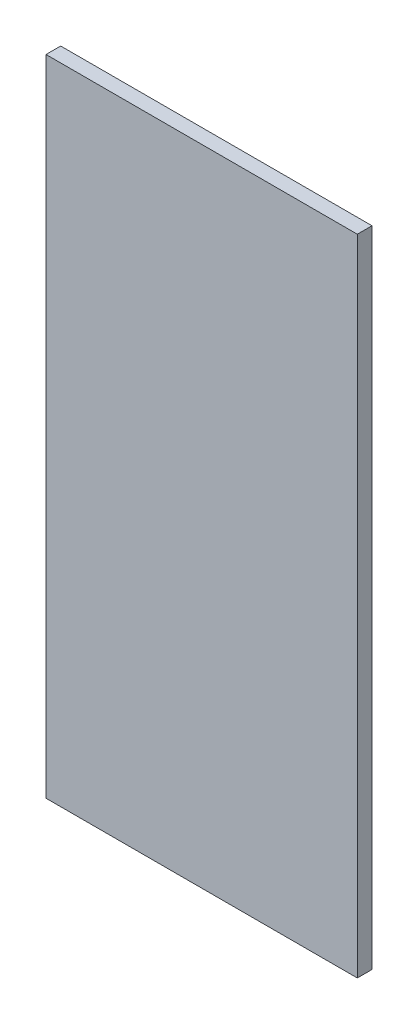
ISO-10303-21;
HEADER;
FILE_DESCRIPTION(('STEP AP214'),'2;1');
FILE_NAME('part.step','',(''),(''),'','','');
FILE_SCHEMA(('AUTOMOTIVE_DESIGN { 1 0 10303 214 1 1 1 1 }'));
ENDSEC;
DATA;
#1=APPLICATION_CONTEXT('core data for automotive mechanical design processes');
#2=APPLICATION_PROTOCOL_DEFINITION('international standard','automotive_design',2000,#1);
#3=PRODUCT_CONTEXT('',#1,'mechanical');
#4=PRODUCT('Part','Part','',(#3));
#5=PRODUCT_RELATED_PRODUCT_CATEGORY('part','',(#4));
#6=PRODUCT_DEFINITION_FORMATION('','',#4);
#7=PRODUCT_DEFINITION_CONTEXT('part definition',#1,'design');
#8=PRODUCT_DEFINITION('design','',#6,#7);
#9=PRODUCT_DEFINITION_SHAPE('','',#8);
#10=(LENGTH_UNIT() NAMED_UNIT(*) SI_UNIT(.MILLI.,.METRE.));
#11=(NAMED_UNIT(*) PLANE_ANGLE_UNIT() SI_UNIT($,.RADIAN.));
#12=(NAMED_UNIT(*) SI_UNIT($,.STERADIAN.) SOLID_ANGLE_UNIT());
#13=UNCERTAINTY_MEASURE_WITH_UNIT(LENGTH_MEASURE(1.E-05),#10,'distance_accuracy_value','');
#14=(GEOMETRIC_REPRESENTATION_CONTEXT(3) GLOBAL_UNCERTAINTY_ASSIGNED_CONTEXT((#13)) GLOBAL_UNIT_ASSIGNED_CONTEXT((#10,
#11,#12)) REPRESENTATION_CONTEXT('',''));
#15=CARTESIAN_POINT('',(0.,0.,0.));
#16=DIRECTION('',(0.,0.,1.));
#17=DIRECTION('',(1.,0.,0.));
#18=AXIS2_PLACEMENT_3D('',#15,#16,#17);
#19=CARTESIAN_POINT('',(860.,658.,-15.));
#20=DIRECTION('',(0.,1.,0.));
#21=DIRECTION('',(-1.,0.,0.));
#22=AXIS2_PLACEMENT_3D('',#19,#20,#21);
#23=PLANE('',#22);
#24=DIRECTION('',(0.,0.,1.));
#25=VECTOR('',#24,1.);
#26=CARTESIAN_POINT('',(579.,658.,-15.));
#27=LINE('',#26,#25);
#28=CARTESIAN_POINT('',(579.,658.,-15.));
#29=VERTEX_POINT('',#28);
#30=CARTESIAN_POINT('',(579.,658.,0.));
#31=VERTEX_POINT('',#30);
#32=EDGE_CURVE('E80',#29,#31,#27,.T.);
#33=ORIENTED_EDGE('',*,*,#32,.T.);
#34=DIRECTION('',(-1.,0.,0.));
#35=VECTOR('',#34,1.);
#36=CARTESIAN_POINT('',(860.,658.,0.));
#37=LINE('',#36,#35);
#38=CARTESIAN_POINT('',(897.,658.,0.));
#39=VERTEX_POINT('',#38);
#40=EDGE_CURVE('E95',#39,#31,#37,.T.);
#41=ORIENTED_EDGE('',*,*,#40,.F.);
#42=DIRECTION('',(0.,0.,1.));
#43=VECTOR('',#42,1.);
#44=CARTESIAN_POINT('',(897.,658.,-15.));
#45=LINE('',#44,#43);
#46=CARTESIAN_POINT('',(897.,658.,-15.));
#47=VERTEX_POINT('',#46);
#48=EDGE_CURVE('E101',#47,#39,#45,.T.);
#49=ORIENTED_EDGE('',*,*,#48,.F.);
#50=DIRECTION('',(-1.,0.,0.));
#51=VECTOR('',#50,1.);
#52=CARTESIAN_POINT('',(860.,658.,-15.));
#53=LINE('',#52,#51);
#54=EDGE_CURVE('E94',#47,#29,#53,.T.);
#55=ORIENTED_EDGE('',*,*,#54,.T.);
#56=EDGE_LOOP('',(#33,#41,#49,#55));
#57=FACE_BOUND('',#56,.T.);
#58=ADVANCED_FACE('F38',(#57),#23,.T.);
#59=CARTESIAN_POINT('',(0.,0.,-15.));
#60=DIRECTION('',(0.,-1.,0.));
#61=DIRECTION('',(0.,0.,-1.));
#62=AXIS2_PLACEMENT_3D('',#59,#60,#61);
#63=PLANE('',#62);
#64=DIRECTION('',(0.,0.,1.));
#65=VECTOR('',#64,1.);
#66=CARTESIAN_POINT('',(579.,0.,-15.));
#67=LINE('',#66,#65);
#68=CARTESIAN_POINT('',(579.,0.,-15.));
#69=VERTEX_POINT('',#68);
#70=CARTESIAN_POINT('',(579.,0.,0.));
#71=VERTEX_POINT('',#70);
#72=EDGE_CURVE('E52',#69,#71,#67,.T.);
#73=ORIENTED_EDGE('',*,*,#72,.F.);
#74=DIRECTION('',(1.,0.,0.));
#75=VECTOR('',#74,1.);
#76=CARTESIAN_POINT('',(0.,0.,-15.));
#77=LINE('',#76,#75);
#78=CARTESIAN_POINT('',(897.,0.,-15.));
#79=VERTEX_POINT('',#78);
#80=EDGE_CURVE('E87',#69,#79,#77,.T.);
#81=ORIENTED_EDGE('',*,*,#80,.T.);
#82=DIRECTION('',(0.,0.,1.));
#83=VECTOR('',#82,1.);
#84=CARTESIAN_POINT('',(897.,0.,-15.));
#85=LINE('',#84,#83);
#86=CARTESIAN_POINT('',(897.,0.,0.));
#87=VERTEX_POINT('',#86);
#88=EDGE_CURVE('E104',#79,#87,#85,.T.);
#89=ORIENTED_EDGE('',*,*,#88,.T.);
#90=DIRECTION('',(1.,0.,0.));
#91=VECTOR('',#90,1.);
#92=CARTESIAN_POINT('',(0.,0.,0.));
#93=LINE('',#92,#91);
#94=EDGE_CURVE('E59',#71,#87,#93,.T.);
#95=ORIENTED_EDGE('',*,*,#94,.F.);
#96=EDGE_LOOP('',(#73,#81,#89,#95));
#97=FACE_BOUND('',#96,.T.);
#98=ADVANCED_FACE('F40',(#97),#63,.T.);
#99=CARTESIAN_POINT('',(0.,0.,-15.));
#100=DIRECTION('',(0.,0.,1.));
#101=DIRECTION('',(1.,0.,0.));
#102=AXIS2_PLACEMENT_3D('',#99,#100,#101);
#103=PLANE('',#102);
#104=ORIENTED_EDGE('',*,*,#80,.F.);
#105=DIRECTION('',(0.,1.,0.));
#106=VECTOR('',#105,1.);
#107=CARTESIAN_POINT('',(579.,658.,-15.));
#108=LINE('',#107,#106);
#109=EDGE_CURVE('E77',#69,#29,#108,.T.);
#110=ORIENTED_EDGE('',*,*,#109,.T.);
#111=ORIENTED_EDGE('',*,*,#54,.F.);
#112=DIRECTION('',(0.,-1.,0.));
#113=VECTOR('',#112,1.);
#114=CARTESIAN_POINT('',(897.,0.,-15.));
#115=LINE('',#114,#113);
#116=EDGE_CURVE('E93',#47,#79,#115,.T.);
#117=ORIENTED_EDGE('',*,*,#116,.T.);
#118=EDGE_LOOP('',(#104,#110,#111,#117));
#119=FACE_BOUND('',#118,.T.);
#120=ADVANCED_FACE('F91',(#119),#103,.F.);
#121=CARTESIAN_POINT('',(0.,0.,0.));
#122=DIRECTION('',(0.,0.,1.));
#123=DIRECTION('',(1.,0.,0.));
#124=AXIS2_PLACEMENT_3D('',#121,#122,#123);
#125=PLANE('',#124);
#126=DIRECTION('',(0.,1.,0.));
#127=VECTOR('',#126,1.);
#128=CARTESIAN_POINT('',(579.,0.,0.));
#129=LINE('',#128,#127);
#130=EDGE_CURVE('E11',#71,#31,#129,.T.);
#131=ORIENTED_EDGE('',*,*,#130,.F.);
#132=ORIENTED_EDGE('',*,*,#94,.T.);
#133=DIRECTION('',(0.,-1.,0.));
#134=VECTOR('',#133,1.);
#135=CARTESIAN_POINT('',(897.,0.,0.));
#136=LINE('',#135,#134);
#137=EDGE_CURVE('E46',#39,#87,#136,.T.);
#138=ORIENTED_EDGE('',*,*,#137,.F.);
#139=ORIENTED_EDGE('',*,*,#40,.T.);
#140=EDGE_LOOP('',(#131,#132,#138,#139));
#141=FACE_BOUND('',#140,.T.);
#142=ADVANCED_FACE('F112',(#141),#125,.T.);
#143=CARTESIAN_POINT('',(897.,0.,-15.));
#144=DIRECTION('',(-1.,0.,0.));
#145=DIRECTION('',(0.,-1.,0.));
#146=AXIS2_PLACEMENT_3D('',#143,#144,#145);
#147=PLANE('',#146);
#148=ORIENTED_EDGE('',*,*,#137,.T.);
#149=ORIENTED_EDGE('',*,*,#88,.F.);
#150=ORIENTED_EDGE('',*,*,#116,.F.);
#151=ORIENTED_EDGE('',*,*,#48,.T.);
#152=EDGE_LOOP('',(#148,#149,#150,#151));
#153=FACE_BOUND('',#152,.T.);
#154=ADVANCED_FACE('F107',(#153),#147,.F.);
#155=CARTESIAN_POINT('',(579.,658.,-15.));
#156=DIRECTION('',(1.,0.,0.));
#157=DIRECTION('',(0.,1.,0.));
#158=AXIS2_PLACEMENT_3D('',#155,#156,#157);
#159=PLANE('',#158);
#160=ORIENTED_EDGE('',*,*,#130,.T.);
#161=ORIENTED_EDGE('',*,*,#32,.F.);
#162=ORIENTED_EDGE('',*,*,#109,.F.);
#163=ORIENTED_EDGE('',*,*,#72,.T.);
#164=EDGE_LOOP('',(#160,#161,#162,#163));
#165=FACE_BOUND('',#164,.T.);
#166=ADVANCED_FACE('F78',(#165),#159,.F.);
#167=CLOSED_SHELL('',(#58,#98,#120,#142,#154,#166));
#168=MANIFOLD_SOLID_BREP('B2',#167);
#169=ADVANCED_BREP_SHAPE_REPRESENTATION('',(#18,#168),#14);
#170=SHAPE_DEFINITION_REPRESENTATION(#9,#169);
ENDSEC;
END-ISO-10303-21;
